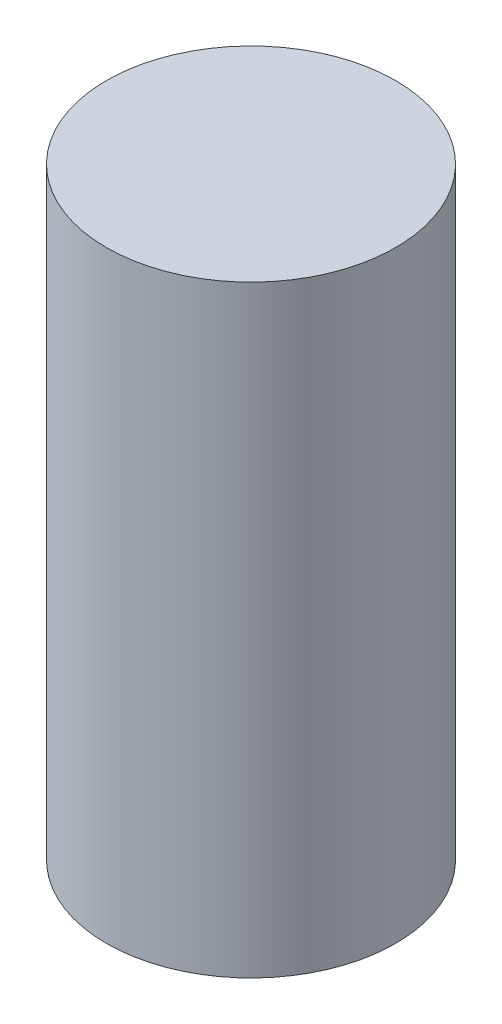
ISO-10303-21;
HEADER;
FILE_DESCRIPTION(('STEP AP214'),'2;1');
FILE_NAME('part.step','',(''),(''),'','','');
FILE_SCHEMA(('AUTOMOTIVE_DESIGN { 1 0 10303 214 1 1 1 1 }'));
ENDSEC;
DATA;
#1=APPLICATION_CONTEXT('core data for automotive mechanical design processes');
#2=APPLICATION_PROTOCOL_DEFINITION('international standard','automotive_design',2000,#1);
#3=PRODUCT_CONTEXT('',#1,'mechanical');
#4=PRODUCT('Part','Part','',(#3));
#5=PRODUCT_RELATED_PRODUCT_CATEGORY('part','',(#4));
#6=PRODUCT_DEFINITION_FORMATION('','',#4);
#7=PRODUCT_DEFINITION_CONTEXT('part definition',#1,'design');
#8=PRODUCT_DEFINITION('design','',#6,#7);
#9=PRODUCT_DEFINITION_SHAPE('','',#8);
#10=(LENGTH_UNIT() NAMED_UNIT(*) SI_UNIT(.MILLI.,.METRE.));
#11=(NAMED_UNIT(*) PLANE_ANGLE_UNIT() SI_UNIT($,.RADIAN.));
#12=(NAMED_UNIT(*) SI_UNIT($,.STERADIAN.) SOLID_ANGLE_UNIT());
#13=UNCERTAINTY_MEASURE_WITH_UNIT(LENGTH_MEASURE(1.E-05),#10,'distance_accuracy_value','');
#14=(GEOMETRIC_REPRESENTATION_CONTEXT(3) GLOBAL_UNCERTAINTY_ASSIGNED_CONTEXT((#13)) GLOBAL_UNIT_ASSIGNED_CONTEXT((#10,
#11,#12)) REPRESENTATION_CONTEXT('',''));
#15=CARTESIAN_POINT('',(0.,0.,0.));
#16=DIRECTION('',(0.,0.,1.));
#17=DIRECTION('',(1.,0.,0.));
#18=AXIS2_PLACEMENT_3D('',#15,#16,#17);
#19=CARTESIAN_POINT('',(0.,8.,0.));
#20=DIRECTION('',(0.,-1.,0.));
#21=DIRECTION('',(0.,0.,1.));
#22=AXIS2_PLACEMENT_3D('',#19,#20,#21);
#23=CYLINDRICAL_SURFACE('',#22,1.92);
#24=CARTESIAN_POINT('',(0.,8.,0.));
#25=DIRECTION('',(0.,-1.,0.));
#26=DIRECTION('',(0.,0.,-1.));
#27=AXIS2_PLACEMENT_3D('',#24,#25,#26);
#28=CIRCLE('',#27,1.92);
#29=CARTESIAN_POINT('',(0.,8.,-1.92));
#30=VERTEX_POINT('',#29);
#31=EDGE_CURVE('E10',#30,#30,#28,.T.);
#32=ORIENTED_EDGE('',*,*,#31,.T.);
#33=EDGE_LOOP('',(#32));
#34=FACE_BOUND('',#33,.T.);
#35=CARTESIAN_POINT('',(0.,0.,0.));
#36=DIRECTION('',(0.,-1.,0.));
#37=DIRECTION('',(0.,0.,-1.));
#38=AXIS2_PLACEMENT_3D('',#35,#36,#37);
#39=CIRCLE('',#38,1.92);
#40=CARTESIAN_POINT('',(0.,0.,-1.92));
#41=VERTEX_POINT('',#40);
#42=EDGE_CURVE('E42',#41,#41,#39,.T.);
#43=ORIENTED_EDGE('',*,*,#42,.F.);
#44=EDGE_LOOP('',(#43));
#45=FACE_BOUND('',#44,.T.);
#46=ADVANCED_FACE('F39',(#34,#45),#23,.T.);
#47=CARTESIAN_POINT('',(0.,8.,0.));
#48=DIRECTION('',(0.,1.,0.));
#49=DIRECTION('',(0.,0.,-1.));
#50=AXIS2_PLACEMENT_3D('',#47,#48,#49);
#51=PLANE('',#50);
#52=ORIENTED_EDGE('',*,*,#31,.F.);
#53=EDGE_LOOP('',(#52));
#54=FACE_BOUND('',#53,.T.);
#55=ADVANCED_FACE('F54',(#54),#51,.T.);
#56=CARTESIAN_POINT('',(0.,0.,0.));
#57=DIRECTION('',(0.,1.,0.));
#58=DIRECTION('',(0.,0.,-1.));
#59=AXIS2_PLACEMENT_3D('',#56,#57,#58);
#60=PLANE('',#59);
#61=ORIENTED_EDGE('',*,*,#42,.T.);
#62=EDGE_LOOP('',(#61));
#63=FACE_BOUND('',#62,.T.);
#64=ADVANCED_FACE('F51',(#63),#60,.F.);
#65=CLOSED_SHELL('',(#46,#55,#64));
#66=MANIFOLD_SOLID_BREP('B2',#65);
#67=ADVANCED_BREP_SHAPE_REPRESENTATION('',(#18,#66),#14);
#68=SHAPE_DEFINITION_REPRESENTATION(#9,#67);
ENDSEC;
END-ISO-10303-21;
